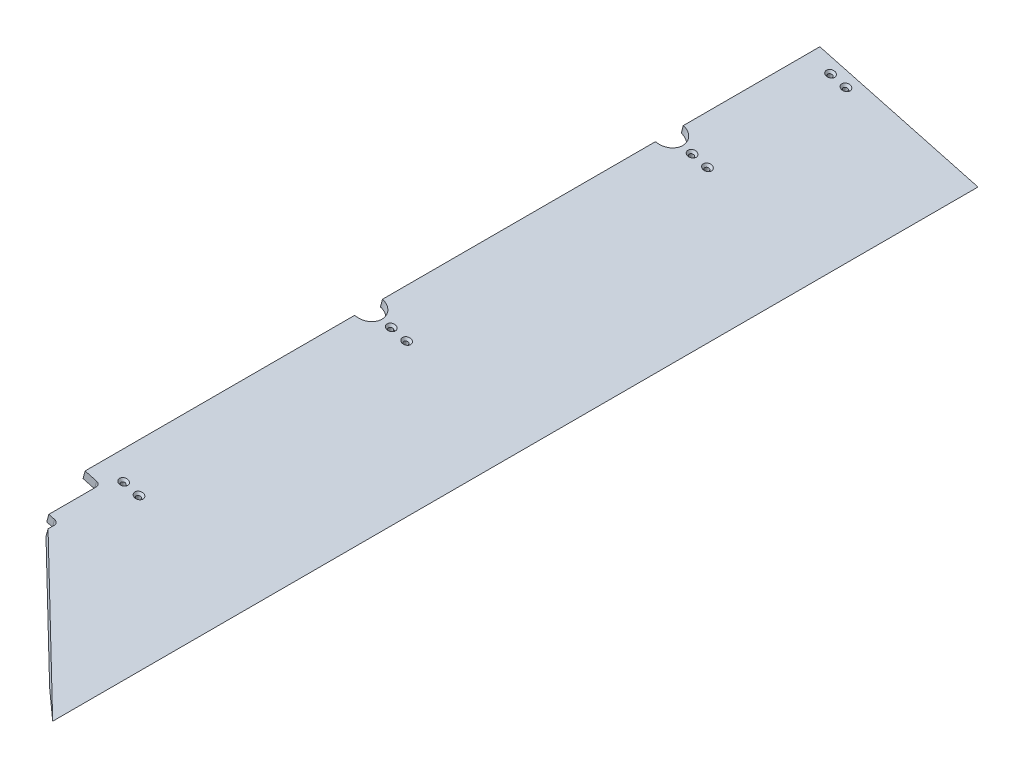
ISO-10303-21;
HEADER;
FILE_DESCRIPTION(('STEP AP214'),'2;1');
FILE_NAME('part.step','',(''),(''),'','','');
FILE_SCHEMA(('AUTOMOTIVE_DESIGN { 1 0 10303 214 1 1 1 1 }'));
ENDSEC;
DATA;
#1=APPLICATION_CONTEXT('core data for automotive mechanical design processes');
#2=APPLICATION_PROTOCOL_DEFINITION('international standard','automotive_design',2000,#1);
#3=PRODUCT_CONTEXT('',#1,'mechanical');
#4=PRODUCT('Part','Part','',(#3));
#5=PRODUCT_RELATED_PRODUCT_CATEGORY('part','',(#4));
#6=PRODUCT_DEFINITION_FORMATION('','',#4);
#7=PRODUCT_DEFINITION_CONTEXT('part definition',#1,'design');
#8=PRODUCT_DEFINITION('design','',#6,#7);
#9=PRODUCT_DEFINITION_SHAPE('','',#8);
#10=(LENGTH_UNIT() NAMED_UNIT(*) SI_UNIT(.MILLI.,.METRE.));
#11=(NAMED_UNIT(*) PLANE_ANGLE_UNIT() SI_UNIT($,.RADIAN.));
#12=(NAMED_UNIT(*) SI_UNIT($,.STERADIAN.) SOLID_ANGLE_UNIT());
#13=UNCERTAINTY_MEASURE_WITH_UNIT(LENGTH_MEASURE(1.E-05),#10,'distance_accuracy_value','');
#14=(GEOMETRIC_REPRESENTATION_CONTEXT(3) GLOBAL_UNCERTAINTY_ASSIGNED_CONTEXT((#13)) GLOBAL_UNIT_ASSIGNED_CONTEXT((#10,
#11,#12)) REPRESENTATION_CONTEXT('',''));
#15=CARTESIAN_POINT('',(0.,0.,0.));
#16=DIRECTION('',(0.,0.,1.));
#17=DIRECTION('',(1.,0.,0.));
#18=AXIS2_PLACEMENT_3D('',#15,#16,#17);
#19=CARTESIAN_POINT('',(25.512001872802,67.770934414059,1479.55));
#20=DIRECTION('',(0.965925826289067,-0.258819045102524,0.));
#21=DIRECTION('',(0.258819045102524,0.965925826289068,0.));
#22=AXIS2_PLACEMENT_3D('',#19,#20,#21);
#23=PLANE('',#22);
#24=DIRECTION('',(0.,0.,-1.));
#25=VECTOR('',#24,1.);
#26=CARTESIAN_POINT('',(22.225,55.5036764201878,1479.55));
#27=LINE('',#26,#25);
#28=CARTESIAN_POINT('',(22.225,55.5036764201878,218.28125));
#29=VERTEX_POINT('',#28);
#30=CARTESIAN_POINT('',(22.225,55.5036764201878,0.));
#31=VERTEX_POINT('',#30);
#32=EDGE_CURVE('E271',#29,#31,#27,.T.);
#33=ORIENTED_EDGE('',*,*,#32,.F.);
#34=DIRECTION('',(0.258819045102524,0.965925826289067,0.));
#35=VECTOR('',#34,1.);
#36=CARTESIAN_POINT('',(8.34908089495289,3.71804131843699,218.28125));
#37=LINE('',#36,#35);
#38=CARTESIAN_POINT('',(25.5120018728021,67.770934414059,218.28125));
#39=VERTEX_POINT('',#38);
#40=EDGE_CURVE('E193',#29,#39,#37,.T.);
#41=ORIENTED_EDGE('',*,*,#40,.T.);
#42=DIRECTION('',(0.,0.,-1.));
#43=VECTOR('',#42,1.);
#44=CARTESIAN_POINT('',(25.512001872802,67.770934414059,1479.55));
#45=LINE('',#44,#43);
#46=CARTESIAN_POINT('',(25.512001872802,67.770934414059,0.));
#47=VERTEX_POINT('',#46);
#48=EDGE_CURVE('E263',#39,#47,#45,.T.);
#49=ORIENTED_EDGE('',*,*,#48,.T.);
#50=DIRECTION('',(-0.258819045102524,-0.965925826289068,0.));
#51=VECTOR('',#50,1.);
#52=CARTESIAN_POINT('',(25.512001872802,67.770934414059,0.));
#53=LINE('',#52,#51);
#54=EDGE_CURVE('E252',#47,#31,#53,.T.);
#55=ORIENTED_EDGE('',*,*,#54,.T.);
#56=EDGE_LOOP('',(#33,#41,#49,#55));
#57=FACE_BOUND('',#56,.T.);
#58=ADVANCED_FACE('F32',(#57),#23,.F.);
#59=CARTESIAN_POINT('',(25.5120018728021,67.770934414059,699.29375));
#60=VERTEX_POINT('',#59);
#61=CARTESIAN_POINT('',(25.512001872802,67.770934414059,262.73125));
#62=VERTEX_POINT('',#61);
#63=EDGE_CURVE('E267',#60,#62,#45,.T.);
#64=ORIENTED_EDGE('',*,*,#63,.T.);
#65=DIRECTION('',(0.258819045102524,0.965925826289067,0.));
#66=VECTOR('',#65,1.);
#67=CARTESIAN_POINT('',(8.34908089495289,3.71804131843699,262.73125));
#68=LINE('',#67,#66);
#69=CARTESIAN_POINT('',(22.225,55.5036764201878,262.73125));
#70=VERTEX_POINT('',#69);
#71=EDGE_CURVE('E190',#62,#70,#68,.F.);
#72=ORIENTED_EDGE('',*,*,#71,.T.);
#73=CARTESIAN_POINT('',(22.225,55.5036764201878,699.29375));
#74=VERTEX_POINT('',#73);
#75=EDGE_CURVE('E275',#74,#70,#27,.T.);
#76=ORIENTED_EDGE('',*,*,#75,.F.);
#77=DIRECTION('',(0.258819045102524,0.965925826289067,0.));
#78=VECTOR('',#77,1.);
#79=CARTESIAN_POINT('',(8.34908089495289,3.718041318437,699.29375));
#80=LINE('',#79,#78);
#81=EDGE_CURVE('E184',#74,#60,#80,.T.);
#82=ORIENTED_EDGE('',*,*,#81,.T.);
#83=EDGE_LOOP('',(#64,#72,#76,#82));
#84=FACE_BOUND('',#83,.T.);
#85=ADVANCED_FACE('F343',(#84),#23,.F.);
#86=CARTESIAN_POINT('',(22.225,55.5036764201878,1174.75));
#87=VERTEX_POINT('',#86);
#88=CARTESIAN_POINT('',(22.225,55.5036764201878,743.74375));
#89=VERTEX_POINT('',#88);
#90=EDGE_CURVE('E272',#87,#89,#27,.T.);
#91=ORIENTED_EDGE('',*,*,#90,.F.);
#92=DIRECTION('',(0.258819045102524,0.965925826289067,0.));
#93=VECTOR('',#92,1.);
#94=CARTESIAN_POINT('',(8.34908089495287,3.71804131843699,1174.75));
#95=LINE('',#94,#93);
#96=CARTESIAN_POINT('',(25.5120018728021,67.770934414059,1174.75));
#97=VERTEX_POINT('',#96);
#98=EDGE_CURVE('E158',#87,#97,#95,.T.);
#99=ORIENTED_EDGE('',*,*,#98,.T.);
#100=CARTESIAN_POINT('',(25.512001872802,67.770934414059,743.74375));
#101=VERTEX_POINT('',#100);
#102=EDGE_CURVE('E264',#97,#101,#45,.T.);
#103=ORIENTED_EDGE('',*,*,#102,.T.);
#104=DIRECTION('',(0.258819045102524,0.965925826289067,0.));
#105=VECTOR('',#104,1.);
#106=CARTESIAN_POINT('',(8.34908089495289,3.718041318437,743.74375));
#107=LINE('',#106,#105);
#108=EDGE_CURVE('E181',#101,#89,#107,.F.);
#109=ORIENTED_EDGE('',*,*,#108,.T.);
#110=EDGE_LOOP('',(#91,#99,#103,#109));
#111=FACE_BOUND('',#110,.T.);
#112=ADVANCED_FACE('F354',(#111),#23,.F.);
#113=CARTESIAN_POINT('',(22.225,55.5036764201878,1479.55));
#114=DIRECTION('',(0.258819045102524,0.965925826289067,0.));
#115=DIRECTION('',(-0.965925826289067,0.258819045102524,0.));
#116=AXIS2_PLACEMENT_3D('',#113,#114,#115);
#117=PLANE('',#116);
#118=CARTESIAN_POINT('',(58.5115491458709,45.7807248804393,721.51875));
#119=DIRECTION('',(0.258819045102524,0.965925826289067,0.));
#120=DIRECTION('',(-0.965925826289067,0.258819045102524,0.));
#121=AXIS2_PLACEMENT_3D('',#118,#119,#120);
#122=CIRCLE('',#121,3.57123999999998);
#123=CARTESIAN_POINT('',(55.0619961979943,46.7050298070713,721.51875));
#124=VERTEX_POINT('',#123);
#125=EDGE_CURVE('E202',#124,#124,#122,.T.);
#126=ORIENTED_EDGE('',*,*,#125,.T.);
#127=EDGE_LOOP('',(#126));
#128=FACE_BOUND('',#127,.T.);
#129=CARTESIAN_POINT('',(83.0460651336132,39.2067211348352,721.51875));
#130=DIRECTION('',(0.258819045102524,0.965925826289067,0.));
#131=DIRECTION('',(-0.965925826289067,0.258819045102524,0.));
#132=AXIS2_PLACEMENT_3D('',#129,#130,#131);
#133=CIRCLE('',#132,3.57123999999998);
#134=CARTESIAN_POINT('',(79.5965121857366,40.1310260614672,721.51875));
#135=VERTEX_POINT('',#134);
#136=EDGE_CURVE('E209',#135,#135,#133,.T.);
#137=ORIENTED_EDGE('',*,*,#136,.T.);
#138=EDGE_LOOP('',(#137));
#139=FACE_BOUND('',#138,.T.);
#140=CARTESIAN_POINT('',(58.5115491458709,45.7807248804393,240.50625));
#141=DIRECTION('',(0.258819045102524,0.965925826289067,0.));
#142=DIRECTION('',(-0.965925826289067,0.258819045102524,0.));
#143=AXIS2_PLACEMENT_3D('',#140,#141,#142);
#144=CIRCLE('',#143,3.57123999999999);
#145=CARTESIAN_POINT('',(55.0619961979943,46.7050298070713,240.50625));
#146=VERTEX_POINT('',#145);
#147=EDGE_CURVE('E216',#146,#146,#144,.T.);
#148=ORIENTED_EDGE('',*,*,#147,.T.);
#149=EDGE_LOOP('',(#148));
#150=FACE_BOUND('',#149,.T.);
#151=CARTESIAN_POINT('',(83.0460651336132,39.2067211348352,240.50625));
#152=DIRECTION('',(0.258819045102524,0.965925826289067,0.));
#153=DIRECTION('',(-0.965925826289067,0.258819045102524,0.));
#154=AXIS2_PLACEMENT_3D('',#151,#152,#153);
#155=CIRCLE('',#154,3.57123999999999);
#156=CARTESIAN_POINT('',(79.5965121857366,40.1310260614672,240.50625));
#157=VERTEX_POINT('',#156);
#158=EDGE_CURVE('E223',#157,#157,#155,.T.);
#159=ORIENTED_EDGE('',*,*,#158,.T.);
#160=EDGE_LOOP('',(#159));
#161=FACE_BOUND('',#160,.T.);
#162=CARTESIAN_POINT('',(58.5115491458709,45.7807248804393,1149.35));
#163=DIRECTION('',(0.258819045102524,0.965925826289067,0.));
#164=DIRECTION('',(-0.965925826289067,0.258819045102524,0.));
#165=AXIS2_PLACEMENT_3D('',#162,#163,#164);
#166=CIRCLE('',#165,3.57124000000009);
#167=CARTESIAN_POINT('',(55.0619961979942,46.7050298070713,1149.35));
#168=VERTEX_POINT('',#167);
#169=EDGE_CURVE('E230',#168,#168,#166,.T.);
#170=ORIENTED_EDGE('',*,*,#169,.T.);
#171=EDGE_LOOP('',(#170));
#172=FACE_BOUND('',#171,.T.);
#173=CARTESIAN_POINT('',(83.0460651336132,39.2067211348352,1149.35));
#174=DIRECTION('',(0.258819045102524,0.965925826289067,0.));
#175=DIRECTION('',(-0.965925826289067,0.258819045102524,0.));
#176=AXIS2_PLACEMENT_3D('',#173,#174,#175);
#177=CIRCLE('',#176,3.57124000000009);
#178=CARTESIAN_POINT('',(79.5965121857365,40.1310260614672,1149.35));
#179=VERTEX_POINT('',#178);
#180=EDGE_CURVE('E237',#179,#179,#177,.T.);
#181=ORIENTED_EDGE('',*,*,#180,.T.);
#182=EDGE_LOOP('',(#181));
#183=FACE_BOUND('',#182,.T.);
#184=CARTESIAN_POINT('',(58.5115491458709,45.7807248804393,19.05));
#185=DIRECTION('',(0.258819045102524,0.965925826289067,0.));
#186=DIRECTION('',(-0.965925826289067,0.258819045102524,0.));
#187=AXIS2_PLACEMENT_3D('',#184,#185,#186);
#188=CIRCLE('',#187,3.57123999999999);
#189=CARTESIAN_POINT('',(55.0619961979943,46.7050298070713,19.05));
#190=VERTEX_POINT('',#189);
#191=EDGE_CURVE('E244',#190,#190,#188,.T.);
#192=ORIENTED_EDGE('',*,*,#191,.T.);
#193=EDGE_LOOP('',(#192));
#194=FACE_BOUND('',#193,.T.);
#195=CARTESIAN_POINT('',(83.0460651336132,39.2067211348352,19.05));
#196=DIRECTION('',(0.258819045102524,0.965925826289067,0.));
#197=DIRECTION('',(-0.965925826289067,0.258819045102524,0.));
#198=AXIS2_PLACEMENT_3D('',#195,#196,#197);
#199=CIRCLE('',#198,3.57123999999999);
#200=CARTESIAN_POINT('',(79.5965121857366,40.1310260614672,19.05));
#201=VERTEX_POINT('',#200);
#202=EDGE_CURVE('E251',#201,#201,#199,.T.);
#203=ORIENTED_EDGE('',*,*,#202,.T.);
#204=EDGE_LOOP('',(#203));
#205=FACE_BOUND('',#204,.T.);
#206=DIRECTION('',(0.,0.,-1.));
#207=VECTOR('',#206,1.);
#208=CARTESIAN_POINT('',(46.7595159877423,48.9296726745837,1479.55));
#209=LINE('',#208,#207);
#210=CARTESIAN_POINT('',(46.7595159877423,48.9296726745837,1257.3));
#211=VERTEX_POINT('',#210);
#212=CARTESIAN_POINT('',(46.7595159877423,48.9296726745837,1181.1));
#213=VERTEX_POINT('',#212);
#214=EDGE_CURVE('E169',#211,#213,#209,.T.);
#215=ORIENTED_EDGE('',*,*,#214,.T.);
#216=CARTESIAN_POINT('',(40.6258869908067,50.5731736109847,1181.1));
#217=DIRECTION('',(0.258819045102524,0.965925826289067,0.));
#218=DIRECTION('',(-0.965925826289067,0.258819045102524,0.));
#219=AXIS2_PLACEMENT_3D('',#216,#217,#218);
#220=CIRCLE('',#219,6.35);
#221=CARTESIAN_POINT('',(40.6258869908067,50.5731736109847,1174.75));
#222=VERTEX_POINT('',#221);
#223=EDGE_CURVE('E302',#213,#222,#220,.T.);
#224=ORIENTED_EDGE('',*,*,#223,.T.);
#225=DIRECTION('',(-0.965925826289067,0.258819045102524,0.));
#226=VECTOR('',#225,1.);
#227=CARTESIAN_POINT('',(22.225,55.5036764201878,1174.75));
#228=LINE('',#227,#226);
#229=EDGE_CURVE('E172',#222,#87,#228,.T.);
#230=ORIENTED_EDGE('',*,*,#229,.T.);
#231=ORIENTED_EDGE('',*,*,#90,.T.);
#232=CARTESIAN_POINT('',(22.225,55.5036764201878,721.51875));
#233=DIRECTION('',(0.258819045102524,0.965925826289067,0.));
#234=DIRECTION('',(-0.965925826289067,0.258819045102524,0.));
#235=AXIS2_PLACEMENT_3D('',#232,#233,#234);
#236=CIRCLE('',#235,22.225);
#237=EDGE_CURVE('E177',#89,#74,#236,.T.);
#238=ORIENTED_EDGE('',*,*,#237,.T.);
#239=ORIENTED_EDGE('',*,*,#75,.T.);
#240=CARTESIAN_POINT('',(22.225,55.5036764201878,240.50625));
#241=DIRECTION('',(0.258819045102524,0.965925826289067,0.));
#242=DIRECTION('',(-0.965925826289067,0.258819045102524,0.));
#243=AXIS2_PLACEMENT_3D('',#240,#241,#242);
#244=CIRCLE('',#243,22.225);
#245=EDGE_CURVE('E187',#70,#29,#244,.T.);
#246=ORIENTED_EDGE('',*,*,#245,.T.);
#247=ORIENTED_EDGE('',*,*,#32,.T.);
#248=DIRECTION('',(0.965925826289067,-0.258819045102524,0.));
#249=VECTOR('',#248,1.);
#250=CARTESIAN_POINT('',(22.225,55.5036764201878,0.));
#251=LINE('',#250,#249);
#252=CARTESIAN_POINT('',(229.367540407001,0.,0.));
#253=VERTEX_POINT('',#252);
#254=EDGE_CURVE('E255',#31,#253,#251,.T.);
#255=ORIENTED_EDGE('',*,*,#254,.T.);
#256=DIRECTION('',(0.,0.,-1.));
#257=VECTOR('',#256,1.);
#258=CARTESIAN_POINT('',(229.367540407001,0.,1479.55));
#259=LINE('',#258,#257);
#260=CARTESIAN_POINT('',(229.367540407001,0.,1435.35154026031));
#261=VERTEX_POINT('',#260);
#262=EDGE_CURVE('E269',#261,#253,#259,.T.);
#263=ORIENTED_EDGE('',*,*,#262,.F.);
#264=DIRECTION('',(-0.706433428546067,0.189288266685271,-0.681998360062496));
#265=VECTOR('',#264,1.);
#266=CARTESIAN_POINT('',(139.865722173839,23.9819399166931,1348.9455311573));
#267=LINE('',#266,#265);
#268=CARTESIAN_POINT('',(62.0935884800813,44.8209203335811,1273.8634845066));
#269=VERTEX_POINT('',#268);
#270=EDGE_CURVE('E164',#261,#269,#267,.T.);
#271=ORIENTED_EDGE('',*,*,#270,.T.);
#272=DIRECTION('',(0.,0.,-1.));
#273=VECTOR('',#272,1.);
#274=CARTESIAN_POINT('',(62.0935884800813,44.8209203335811,1479.55));
#275=LINE('',#274,#273);
#276=CARTESIAN_POINT('',(62.0935884800813,44.8209203335811,1263.65));
#277=VERTEX_POINT('',#276);
#278=EDGE_CURVE('E134',#269,#277,#275,.T.);
#279=ORIENTED_EDGE('',*,*,#278,.T.);
#280=CARTESIAN_POINT('',(55.9599594831457,46.4644212699822,1263.65));
#281=DIRECTION('',(0.258819045102524,0.965925826289067,0.));
#282=DIRECTION('',(-0.965925826289067,0.258819045102524,0.));
#283=AXIS2_PLACEMENT_3D('',#280,#281,#282);
#284=CIRCLE('',#283,6.35);
#285=CARTESIAN_POINT('',(55.9599594831457,46.4644212699822,1257.3));
#286=VERTEX_POINT('',#285);
#287=EDGE_CURVE('E11',#277,#286,#284,.T.);
#288=ORIENTED_EDGE('',*,*,#287,.T.);
#289=DIRECTION('',(-0.965925826289067,0.258819045102524,0.));
#290=VECTOR('',#289,1.);
#291=CARTESIAN_POINT('',(22.225,55.5036764201878,1257.3));
#292=LINE('',#291,#290);
#293=EDGE_CURVE('E167',#286,#211,#292,.T.);
#294=ORIENTED_EDGE('',*,*,#293,.T.);
#295=EDGE_LOOP('',(#215,#224,#230,#231,#238,#239,#246,#247,#255,#263,#271,#279,#288,#294));
#296=FACE_BOUND('',#295,.T.);
#297=ADVANCED_FACE('F306',(#128,#139,#150,#161,#172,#183,#194,#205,#296),#117,.F.);
#298=CARTESIAN_POINT('',(229.367540407001,0.,1479.55));
#299=DIRECTION('',(0.,1.,0.));
#300=DIRECTION('',(0.,0.,1.));
#301=AXIS2_PLACEMENT_3D('',#298,#299,#300);
#302=PLANE('',#301);
#303=DIRECTION('',(0.,0.,-1.));
#304=VECTOR('',#303,1.);
#305=CARTESIAN_POINT('',(278.436572382485,0.,1479.55));
#306=LINE('',#305,#304);
#307=CARTESIAN_POINT('',(278.436572382485,0.,1479.55));
#308=VERTEX_POINT('',#307);
#309=CARTESIAN_POINT('',(278.436572382485,0.,0.));
#310=VERTEX_POINT('',#309);
#311=EDGE_CURVE('E266',#308,#310,#306,.T.);
#312=ORIENTED_EDGE('',*,*,#311,.F.);
#313=DIRECTION('',(-0.743020535718653,0.,-0.669268618344209));
#314=VECTOR('',#313,1.);
#315=CARTESIAN_POINT('',(251.346564934355,0.,1455.14893571689));
#316=LINE('',#315,#314);
#317=EDGE_CURVE('E144',#308,#261,#316,.T.);
#318=ORIENTED_EDGE('',*,*,#317,.T.);
#319=ORIENTED_EDGE('',*,*,#262,.T.);
#320=DIRECTION('',(1.,0.,0.));
#321=VECTOR('',#320,1.);
#322=CARTESIAN_POINT('',(229.367540407001,0.,0.));
#323=LINE('',#322,#321);
#324=EDGE_CURVE('E258',#253,#310,#323,.T.);
#325=ORIENTED_EDGE('',*,*,#324,.T.);
#326=EDGE_LOOP('',(#312,#318,#319,#325));
#327=FACE_BOUND('',#326,.T.);
#328=ADVANCED_FACE('F329',(#327),#302,.F.);
#329=CARTESIAN_POINT('',(278.436572382485,0.,1479.55));
#330=DIRECTION('',(-0.258819045102524,-0.965925826289067,0.));
#331=DIRECTION('',(0.965925826289068,-0.258819045102524,0.));
#332=AXIS2_PLACEMENT_3D('',#329,#330,#331);
#333=PLANE('',#332);
#334=CARTESIAN_POINT('',(61.7985510186729,58.0479828743105,721.51875));
#335=DIRECTION('',(0.258819045102524,0.965925826289068,0.));
#336=DIRECTION('',(-0.965925826289068,0.258819045102524,0.));
#337=AXIS2_PLACEMENT_3D('',#334,#335,#336);
#338=CIRCLE('',#337,6.74370000000002);
#339=CARTESIAN_POINT('',(55.2846370239273,59.7933808687684,721.51875));
#340=VERTEX_POINT('',#339);
#341=EDGE_CURVE('E196',#340,#340,#338,.T.);
#342=ORIENTED_EDGE('',*,*,#341,.F.);
#343=EDGE_LOOP('',(#342));
#344=FACE_BOUND('',#343,.T.);
#345=CARTESIAN_POINT('',(86.3330670064153,51.4739791287064,721.51875));
#346=DIRECTION('',(0.258819045102524,0.965925826289068,0.));
#347=DIRECTION('',(-0.965925826289068,0.258819045102524,0.));
#348=AXIS2_PLACEMENT_3D('',#345,#346,#347);
#349=CIRCLE('',#348,6.74370000000002);
#350=CARTESIAN_POINT('',(79.8191530116697,53.2193771231643,721.51875));
#351=VERTEX_POINT('',#350);
#352=EDGE_CURVE('E203',#351,#351,#349,.T.);
#353=ORIENTED_EDGE('',*,*,#352,.F.);
#354=EDGE_LOOP('',(#353));
#355=FACE_BOUND('',#354,.T.);
#356=CARTESIAN_POINT('',(61.7985510186729,58.0479828743105,240.50625));
#357=DIRECTION('',(0.258819045102524,0.965925826289068,0.));
#358=DIRECTION('',(-0.965925826289068,0.258819045102524,0.));
#359=AXIS2_PLACEMENT_3D('',#356,#357,#358);
#360=CIRCLE('',#359,6.74369999999999);
#361=CARTESIAN_POINT('',(55.2846370239274,59.7933808687684,240.50625));
#362=VERTEX_POINT('',#361);
#363=EDGE_CURVE('E210',#362,#362,#360,.T.);
#364=ORIENTED_EDGE('',*,*,#363,.F.);
#365=EDGE_LOOP('',(#364));
#366=FACE_BOUND('',#365,.T.);
#367=CARTESIAN_POINT('',(86.3330670064153,51.4739791287064,240.50625));
#368=DIRECTION('',(0.258819045102524,0.965925826289068,0.));
#369=DIRECTION('',(-0.965925826289068,0.258819045102524,0.));
#370=AXIS2_PLACEMENT_3D('',#367,#368,#369);
#371=CIRCLE('',#370,6.74369999999999);
#372=CARTESIAN_POINT('',(79.8191530116697,53.2193771231643,240.50625));
#373=VERTEX_POINT('',#372);
#374=EDGE_CURVE('E217',#373,#373,#371,.T.);
#375=ORIENTED_EDGE('',*,*,#374,.F.);
#376=EDGE_LOOP('',(#375));
#377=FACE_BOUND('',#376,.T.);
#378=CARTESIAN_POINT('',(61.798551018673,58.0479828743105,1149.35));
#379=DIRECTION('',(0.258819045102524,0.965925826289068,0.));
#380=DIRECTION('',(-0.965925826289068,0.258819045102524,0.));
#381=AXIS2_PLACEMENT_3D('',#378,#379,#380);
#382=CIRCLE('',#381,6.74369999999991);
#383=CARTESIAN_POINT('',(55.2846370239275,59.7933808687684,1149.35));
#384=VERTEX_POINT('',#383);
#385=EDGE_CURVE('E224',#384,#384,#382,.T.);
#386=ORIENTED_EDGE('',*,*,#385,.F.);
#387=EDGE_LOOP('',(#386));
#388=FACE_BOUND('',#387,.T.);
#389=CARTESIAN_POINT('',(86.3330670064153,51.4739791287064,1149.35));
#390=DIRECTION('',(0.258819045102524,0.965925826289068,0.));
#391=DIRECTION('',(-0.965925826289068,0.258819045102524,0.));
#392=AXIS2_PLACEMENT_3D('',#389,#390,#391);
#393=CIRCLE('',#392,6.74369999999991);
#394=CARTESIAN_POINT('',(79.8191530116698,53.2193771231643,1149.35));
#395=VERTEX_POINT('',#394);
#396=EDGE_CURVE('E231',#395,#395,#393,.T.);
#397=ORIENTED_EDGE('',*,*,#396,.F.);
#398=EDGE_LOOP('',(#397));
#399=FACE_BOUND('',#398,.T.);
#400=CARTESIAN_POINT('',(61.798551018673,58.0479828743105,19.05));
#401=DIRECTION('',(0.258819045102524,0.965925826289068,0.));
#402=DIRECTION('',(-0.965925826289068,0.258819045102524,0.));
#403=AXIS2_PLACEMENT_3D('',#400,#401,#402);
#404=CIRCLE('',#403,6.7437);
#405=CARTESIAN_POINT('',(55.2846370239274,59.7933808687684,19.05));
#406=VERTEX_POINT('',#405);
#407=EDGE_CURVE('E238',#406,#406,#404,.T.);
#408=ORIENTED_EDGE('',*,*,#407,.F.);
#409=EDGE_LOOP('',(#408));
#410=FACE_BOUND('',#409,.T.);
#411=CARTESIAN_POINT('',(86.3330670064153,51.4739791287064,19.05));
#412=DIRECTION('',(0.258819045102524,0.965925826289068,0.));
#413=DIRECTION('',(-0.965925826289068,0.258819045102524,0.));
#414=AXIS2_PLACEMENT_3D('',#411,#412,#413);
#415=CIRCLE('',#414,6.7437);
#416=CARTESIAN_POINT('',(79.8191530116697,53.2193771231643,19.05));
#417=VERTEX_POINT('',#416);
#418=EDGE_CURVE('E245',#417,#417,#415,.T.);
#419=ORIENTED_EDGE('',*,*,#418,.F.);
#420=EDGE_LOOP('',(#419));
#421=FACE_BOUND('',#420,.T.);
#422=ORIENTED_EDGE('',*,*,#102,.F.);
#423=DIRECTION('',(-0.965925826289067,0.258819045102524,0.));
#424=VECTOR('',#423,1.);
#425=CARTESIAN_POINT('',(50.0465178605444,61.1969306684549,1174.75));
#426=LINE('',#425,#424);
#427=CARTESIAN_POINT('',(43.9128888636088,62.8404316048559,1174.75));
#428=VERTEX_POINT('',#427);
#429=EDGE_CURVE('E138',#428,#97,#426,.T.);
#430=ORIENTED_EDGE('',*,*,#429,.F.);
#431=CARTESIAN_POINT('',(43.9128888636088,62.8404316048559,1181.1));
#432=DIRECTION('',(-0.258819045102524,-0.965925826289067,0.));
#433=DIRECTION('',(0.965925826289068,-0.258819045102524,0.));
#434=AXIS2_PLACEMENT_3D('',#431,#432,#433);
#435=CIRCLE('',#434,6.35);
#436=CARTESIAN_POINT('',(50.0465178605444,61.1969306684549,1181.1));
#437=VERTEX_POINT('',#436);
#438=EDGE_CURVE('E300',#428,#437,#435,.T.);
#439=ORIENTED_EDGE('',*,*,#438,.T.);
#440=DIRECTION('',(0.,0.,-1.));
#441=VECTOR('',#440,1.);
#442=CARTESIAN_POINT('',(50.0465178605444,61.1969306684549,1257.3));
#443=LINE('',#442,#441);
#444=CARTESIAN_POINT('',(50.0465178605444,61.1969306684549,1257.3));
#445=VERTEX_POINT('',#444);
#446=EDGE_CURVE('E152',#445,#437,#443,.T.);
#447=ORIENTED_EDGE('',*,*,#446,.F.);
#448=DIRECTION('',(-0.965925826289067,0.258819045102524,0.));
#449=VECTOR('',#448,1.);
#450=CARTESIAN_POINT('',(65.3805903528833,57.0881783274523,1257.3));
#451=LINE('',#450,#449);
#452=CARTESIAN_POINT('',(59.2469613559478,58.7316792638534,1257.3));
#453=VERTEX_POINT('',#452);
#454=EDGE_CURVE('E150',#453,#445,#451,.T.);
#455=ORIENTED_EDGE('',*,*,#454,.F.);
#456=CARTESIAN_POINT('',(59.2469613559478,58.7316792638533,1263.65));
#457=DIRECTION('',(-0.258819045102524,-0.965925826289067,0.));
#458=DIRECTION('',(0.965925826289068,-0.258819045102524,0.));
#459=AXIS2_PLACEMENT_3D('',#456,#457,#458);
#460=CIRCLE('',#459,6.35);
#461=CARTESIAN_POINT('',(65.3805903528833,57.0881783274523,1263.65));
#462=VERTEX_POINT('',#461);
#463=EDGE_CURVE('E40',#453,#462,#460,.T.);
#464=ORIENTED_EDGE('',*,*,#463,.T.);
#465=DIRECTION('',(0.,0.,-1.));
#466=VECTOR('',#465,1.);
#467=CARTESIAN_POINT('',(65.3805903528833,57.0881783274523,1273.8634845066));
#468=LINE('',#467,#466);
#469=CARTESIAN_POINT('',(65.3805903528833,57.0881783274523,1273.8634845066));
#470=VERTEX_POINT('',#469);
#471=EDGE_CURVE('E133',#470,#462,#468,.T.);
#472=ORIENTED_EDGE('',*,*,#471,.F.);
#473=DIRECTION('',(-0.706433428546067,0.18928826668527,-0.681998360062496));
#474=VECTOR('',#473,1.);
#475=CARTESIAN_POINT('',(278.436572382485,0.,1479.55));
#476=LINE('',#475,#474);
#477=EDGE_CURVE('E141',#308,#470,#476,.T.);
#478=ORIENTED_EDGE('',*,*,#477,.F.);
#479=ORIENTED_EDGE('',*,*,#311,.T.);
#480=DIRECTION('',(-0.965925826289068,0.258819045102524,0.));
#481=VECTOR('',#480,1.);
#482=CARTESIAN_POINT('',(278.436572382485,0.,0.));
#483=LINE('',#482,#481);
#484=EDGE_CURVE('E260',#310,#47,#483,.T.);
#485=ORIENTED_EDGE('',*,*,#484,.T.);
#486=ORIENTED_EDGE('',*,*,#48,.F.);
#487=CARTESIAN_POINT('',(25.512001872802,67.770934414059,240.50625));
#488=DIRECTION('',(0.258819045102524,0.965925826289068,0.));
#489=DIRECTION('',(-0.965925826289068,0.258819045102524,0.));
#490=AXIS2_PLACEMENT_3D('',#487,#488,#489);
#491=CIRCLE('',#490,22.225);
#492=EDGE_CURVE('E175',#62,#39,#491,.T.);
#493=ORIENTED_EDGE('',*,*,#492,.F.);
#494=ORIENTED_EDGE('',*,*,#63,.F.);
#495=CARTESIAN_POINT('',(25.5120018728021,67.770934414059,721.51875));
#496=DIRECTION('',(0.258819045102524,0.965925826289068,0.));
#497=DIRECTION('',(-0.965925826289068,0.258819045102524,0.));
#498=AXIS2_PLACEMENT_3D('',#495,#496,#497);
#499=CIRCLE('',#498,22.225);
#500=EDGE_CURVE('E174',#101,#60,#499,.T.);
#501=ORIENTED_EDGE('',*,*,#500,.F.);
#502=EDGE_LOOP('',(#422,#430,#439,#447,#455,#464,#472,#478,#479,#485,#486,#493,#494,#501));
#503=FACE_BOUND('',#502,.T.);
#504=ADVANCED_FACE('F149',(#344,#355,#366,#377,#388,#399,#410,#421,#503),#333,.F.);
#505=CARTESIAN_POINT('',(0.,0.,0.));
#506=DIRECTION('',(0.,0.,1.));
#507=DIRECTION('',(1.,0.,0.));
#508=AXIS2_PLACEMENT_3D('',#505,#506,#507);
#509=PLANE('',#508);
#510=ORIENTED_EDGE('',*,*,#54,.F.);
#511=ORIENTED_EDGE('',*,*,#484,.F.);
#512=ORIENTED_EDGE('',*,*,#324,.F.);
#513=ORIENTED_EDGE('',*,*,#254,.F.);
#514=EDGE_LOOP('',(#510,#511,#512,#513));
#515=FACE_BOUND('',#514,.T.);
#516=ADVANCED_FACE('F335',(#515),#509,.F.);
#517=CARTESIAN_POINT('',(86.3330670064153,51.4739791287064,19.05));
#518=DIRECTION('',(0.258819045102524,0.965925826289068,0.));
#519=DIRECTION('',(-0.965925826289068,0.258819045102524,0.));
#520=AXIS2_PLACEMENT_3D('',#517,#518,#519);
#521=CYLINDRICAL_SURFACE('',#520,3.57123999999999);
#522=CARTESIAN_POINT('',(85.3885074818001,47.9488349920696,19.05));
#523=DIRECTION('',(0.258819045102524,0.965925826289068,0.));
#524=DIRECTION('',(-0.965925826289068,0.258819045102524,0.));
#525=AXIS2_PLACEMENT_3D('',#522,#523,#524);
#526=CIRCLE('',#525,3.57124);
#527=CARTESIAN_POINT('',(81.9389545339235,48.8731399187016,19.05));
#528=VERTEX_POINT('',#527);
#529=EDGE_CURVE('E248',#528,#528,#526,.T.);
#530=ORIENTED_EDGE('',*,*,#529,.T.);
#531=EDGE_LOOP('',(#530));
#532=FACE_BOUND('',#531,.T.);
#533=ORIENTED_EDGE('',*,*,#202,.F.);
#534=EDGE_LOOP('',(#533));
#535=FACE_BOUND('',#534,.T.);
#536=ADVANCED_FACE('F535',(#532,#535),#521,.F.);
#537=CARTESIAN_POINT('',(86.3330670064153,51.4739791287064,19.05));
#538=DIRECTION('',(0.258819045102524,0.965925826289068,0.));
#539=DIRECTION('',(-0.965925826289068,0.258819045102524,0.));
#540=AXIS2_PLACEMENT_3D('',#537,#538,#539);
#541=CONICAL_SURFACE('',#540,6.7437,0.715584993317675);
#542=ORIENTED_EDGE('',*,*,#529,.F.);
#543=EDGE_LOOP('',(#542));
#544=FACE_BOUND('',#543,.T.);
#545=ORIENTED_EDGE('',*,*,#418,.T.);
#546=EDGE_LOOP('',(#545));
#547=FACE_BOUND('',#546,.T.);
#548=ADVANCED_FACE('F531',(#544,#547),#541,.F.);
#549=CARTESIAN_POINT('',(61.798551018673,58.0479828743105,19.05));
#550=DIRECTION('',(0.258819045102524,0.965925826289068,0.));
#551=DIRECTION('',(-0.965925826289068,0.258819045102524,0.));
#552=AXIS2_PLACEMENT_3D('',#549,#550,#551);
#553=CYLINDRICAL_SURFACE('',#552,3.57123999999999);
#554=CARTESIAN_POINT('',(60.8539914940578,54.5228387376737,19.05));
#555=DIRECTION('',(0.258819045102524,0.965925826289068,0.));
#556=DIRECTION('',(-0.965925826289068,0.258819045102524,0.));
#557=AXIS2_PLACEMENT_3D('',#554,#555,#556);
#558=CIRCLE('',#557,3.57124);
#559=CARTESIAN_POINT('',(57.4044385461812,55.4471436643057,19.05));
#560=VERTEX_POINT('',#559);
#561=EDGE_CURVE('E241',#560,#560,#558,.T.);
#562=ORIENTED_EDGE('',*,*,#561,.T.);
#563=EDGE_LOOP('',(#562));
#564=FACE_BOUND('',#563,.T.);
#565=ORIENTED_EDGE('',*,*,#191,.F.);
#566=EDGE_LOOP('',(#565));
#567=FACE_BOUND('',#566,.T.);
#568=ADVANCED_FACE('F527',(#564,#567),#553,.F.);
#569=CARTESIAN_POINT('',(61.798551018673,58.0479828743105,19.05));
#570=DIRECTION('',(0.258819045102524,0.965925826289068,0.));
#571=DIRECTION('',(-0.965925826289068,0.258819045102524,0.));
#572=AXIS2_PLACEMENT_3D('',#569,#570,#571);
#573=CONICAL_SURFACE('',#572,6.7437,0.715584993317675);
#574=ORIENTED_EDGE('',*,*,#561,.F.);
#575=EDGE_LOOP('',(#574));
#576=FACE_BOUND('',#575,.T.);
#577=ORIENTED_EDGE('',*,*,#407,.T.);
#578=EDGE_LOOP('',(#577));
#579=FACE_BOUND('',#578,.T.);
#580=ADVANCED_FACE('F523',(#576,#579),#573,.F.);
#581=CARTESIAN_POINT('',(86.3330670064153,51.4739791287064,1149.35));
#582=DIRECTION('',(0.258819045102524,0.965925826289068,0.));
#583=DIRECTION('',(-0.965925826289068,0.258819045102524,0.));
#584=AXIS2_PLACEMENT_3D('',#581,#582,#583);
#585=CYLINDRICAL_SURFACE('',#584,3.57124000000009);
#586=CARTESIAN_POINT('',(85.3885074818001,47.9488349920696,1149.35));
#587=DIRECTION('',(0.258819045102524,0.965925826289068,0.));
#588=DIRECTION('',(-0.965925826289068,0.258819045102524,0.));
#589=AXIS2_PLACEMENT_3D('',#586,#587,#588);
#590=CIRCLE('',#589,3.57124000000009);
#591=CARTESIAN_POINT('',(81.9389545339235,48.8731399187016,1149.35));
#592=VERTEX_POINT('',#591);
#593=EDGE_CURVE('E234',#592,#592,#590,.T.);
#594=ORIENTED_EDGE('',*,*,#593,.T.);
#595=EDGE_LOOP('',(#594));
#596=FACE_BOUND('',#595,.T.);
#597=ORIENTED_EDGE('',*,*,#180,.F.);
#598=EDGE_LOOP('',(#597));
#599=FACE_BOUND('',#598,.T.);
#600=ADVANCED_FACE('F519',(#596,#599),#585,.F.);
#601=CARTESIAN_POINT('',(86.3330670064153,51.4739791287064,1149.35));
#602=DIRECTION('',(0.258819045102524,0.965925826289068,0.));
#603=DIRECTION('',(-0.965925826289068,0.258819045102524,0.));
#604=AXIS2_PLACEMENT_3D('',#601,#602,#603);
#605=CONICAL_SURFACE('',#604,6.74369999999991,0.715584993317647);
#606=ORIENTED_EDGE('',*,*,#593,.F.);
#607=EDGE_LOOP('',(#606));
#608=FACE_BOUND('',#607,.T.);
#609=ORIENTED_EDGE('',*,*,#396,.T.);
#610=EDGE_LOOP('',(#609));
#611=FACE_BOUND('',#610,.T.);
#612=ADVANCED_FACE('F515',(#608,#611),#605,.F.);
#613=CARTESIAN_POINT('',(61.798551018673,58.0479828743105,1149.35));
#614=DIRECTION('',(0.258819045102524,0.965925826289068,0.));
#615=DIRECTION('',(-0.965925826289068,0.258819045102524,0.));
#616=AXIS2_PLACEMENT_3D('',#613,#614,#615);
#617=CYLINDRICAL_SURFACE('',#616,3.57124000000009);
#618=CARTESIAN_POINT('',(60.8539914940578,54.5228387376737,1149.35));
#619=DIRECTION('',(0.258819045102524,0.965925826289068,0.));
#620=DIRECTION('',(-0.965925826289068,0.258819045102524,0.));
#621=AXIS2_PLACEMENT_3D('',#618,#619,#620);
#622=CIRCLE('',#621,3.57124000000009);
#623=CARTESIAN_POINT('',(57.4044385461811,55.4471436643057,1149.35));
#624=VERTEX_POINT('',#623);
#625=EDGE_CURVE('E227',#624,#624,#622,.T.);
#626=ORIENTED_EDGE('',*,*,#625,.T.);
#627=EDGE_LOOP('',(#626));
#628=FACE_BOUND('',#627,.T.);
#629=ORIENTED_EDGE('',*,*,#169,.F.);
#630=EDGE_LOOP('',(#629));
#631=FACE_BOUND('',#630,.T.);
#632=ADVANCED_FACE('F511',(#628,#631),#617,.F.);
#633=CARTESIAN_POINT('',(61.798551018673,58.0479828743105,1149.35));
#634=DIRECTION('',(0.258819045102524,0.965925826289068,0.));
#635=DIRECTION('',(-0.965925826289068,0.258819045102524,0.));
#636=AXIS2_PLACEMENT_3D('',#633,#634,#635);
#637=CONICAL_SURFACE('',#636,6.74369999999991,0.715584993317647);
#638=ORIENTED_EDGE('',*,*,#625,.F.);
#639=EDGE_LOOP('',(#638));
#640=FACE_BOUND('',#639,.T.);
#641=ORIENTED_EDGE('',*,*,#385,.T.);
#642=EDGE_LOOP('',(#641));
#643=FACE_BOUND('',#642,.T.);
#644=ADVANCED_FACE('F507',(#640,#643),#637,.F.);
#645=CARTESIAN_POINT('',(86.3330670064153,51.4739791287064,240.50625));
#646=DIRECTION('',(0.258819045102524,0.965925826289068,0.));
#647=DIRECTION('',(-0.965925826289068,0.258819045102524,0.));
#648=AXIS2_PLACEMENT_3D('',#645,#646,#647);
#649=CYLINDRICAL_SURFACE('',#648,3.57123999999999);
#650=CARTESIAN_POINT('',(85.3885074818001,47.9488349920696,240.50625));
#651=DIRECTION('',(0.258819045102524,0.965925826289068,0.));
#652=DIRECTION('',(-0.965925826289068,0.258819045102524,0.));
#653=AXIS2_PLACEMENT_3D('',#650,#651,#652);
#654=CIRCLE('',#653,3.57124);
#655=CARTESIAN_POINT('',(81.9389545339235,48.8731399187016,240.50625));
#656=VERTEX_POINT('',#655);
#657=EDGE_CURVE('E220',#656,#656,#654,.T.);
#658=ORIENTED_EDGE('',*,*,#657,.T.);
#659=EDGE_LOOP('',(#658));
#660=FACE_BOUND('',#659,.T.);
#661=ORIENTED_EDGE('',*,*,#158,.F.);
#662=EDGE_LOOP('',(#661));
#663=FACE_BOUND('',#662,.T.);
#664=ADVANCED_FACE('F503',(#660,#663),#649,.F.);
#665=CARTESIAN_POINT('',(86.3330670064153,51.4739791287064,240.50625));
#666=DIRECTION('',(0.258819045102524,0.965925826289068,0.));
#667=DIRECTION('',(-0.965925826289068,0.258819045102524,0.));
#668=AXIS2_PLACEMENT_3D('',#665,#666,#667);
#669=CONICAL_SURFACE('',#668,6.74369999999999,0.715584993317673);
#670=ORIENTED_EDGE('',*,*,#657,.F.);
#671=EDGE_LOOP('',(#670));
#672=FACE_BOUND('',#671,.T.);
#673=ORIENTED_EDGE('',*,*,#374,.T.);
#674=EDGE_LOOP('',(#673));
#675=FACE_BOUND('',#674,.T.);
#676=ADVANCED_FACE('F499',(#672,#675),#669,.F.);
#677=CARTESIAN_POINT('',(61.7985510186729,58.0479828743105,240.50625));
#678=DIRECTION('',(0.258819045102524,0.965925826289068,0.));
#679=DIRECTION('',(-0.965925826289068,0.258819045102524,0.));
#680=AXIS2_PLACEMENT_3D('',#677,#678,#679);
#681=CYLINDRICAL_SURFACE('',#680,3.57123999999999);
#682=CARTESIAN_POINT('',(60.8539914940578,54.5228387376737,240.50625));
#683=DIRECTION('',(0.258819045102524,0.965925826289068,0.));
#684=DIRECTION('',(-0.965925826289068,0.258819045102524,0.));
#685=AXIS2_PLACEMENT_3D('',#682,#683,#684);
#686=CIRCLE('',#685,3.57124);
#687=CARTESIAN_POINT('',(57.4044385461812,55.4471436643057,240.50625));
#688=VERTEX_POINT('',#687);
#689=EDGE_CURVE('E213',#688,#688,#686,.T.);
#690=ORIENTED_EDGE('',*,*,#689,.T.);
#691=EDGE_LOOP('',(#690));
#692=FACE_BOUND('',#691,.T.);
#693=ORIENTED_EDGE('',*,*,#147,.F.);
#694=EDGE_LOOP('',(#693));
#695=FACE_BOUND('',#694,.T.);
#696=ADVANCED_FACE('F495',(#692,#695),#681,.F.);
#697=CARTESIAN_POINT('',(61.7985510186729,58.0479828743105,240.50625));
#698=DIRECTION('',(0.258819045102524,0.965925826289068,0.));
#699=DIRECTION('',(-0.965925826289068,0.258819045102524,0.));
#700=AXIS2_PLACEMENT_3D('',#697,#698,#699);
#701=CONICAL_SURFACE('',#700,6.74369999999999,0.715584993317673);
#702=ORIENTED_EDGE('',*,*,#689,.F.);
#703=EDGE_LOOP('',(#702));
#704=FACE_BOUND('',#703,.T.);
#705=ORIENTED_EDGE('',*,*,#363,.T.);
#706=EDGE_LOOP('',(#705));
#707=FACE_BOUND('',#706,.T.);
#708=ADVANCED_FACE('F491',(#704,#707),#701,.F.);
#709=CARTESIAN_POINT('',(86.3330670064153,51.4739791287064,721.51875));
#710=DIRECTION('',(0.258819045102524,0.965925826289068,0.));
#711=DIRECTION('',(-0.965925826289068,0.258819045102524,0.));
#712=AXIS2_PLACEMENT_3D('',#709,#710,#711);
#713=CYLINDRICAL_SURFACE('',#712,3.57123999999998);
#714=CARTESIAN_POINT('',(85.3885074818001,47.9488349920696,721.51875));
#715=DIRECTION('',(0.258819045102524,0.965925826289068,0.));
#716=DIRECTION('',(-0.965925826289068,0.258819045102524,0.));
#717=AXIS2_PLACEMENT_3D('',#714,#715,#716);
#718=CIRCLE('',#717,3.57123999999998);
#719=CARTESIAN_POINT('',(81.9389545339236,48.8731399187016,721.51875));
#720=VERTEX_POINT('',#719);
#721=EDGE_CURVE('E206',#720,#720,#718,.T.);
#722=ORIENTED_EDGE('',*,*,#721,.T.);
#723=EDGE_LOOP('',(#722));
#724=FACE_BOUND('',#723,.T.);
#725=ORIENTED_EDGE('',*,*,#136,.F.);
#726=EDGE_LOOP('',(#725));
#727=FACE_BOUND('',#726,.T.);
#728=ADVANCED_FACE('F487',(#724,#727),#713,.F.);
#729=CARTESIAN_POINT('',(86.3330670064153,51.4739791287064,721.51875));
#730=DIRECTION('',(0.258819045102524,0.965925826289068,0.));
#731=DIRECTION('',(-0.965925826289068,0.258819045102524,0.));
#732=AXIS2_PLACEMENT_3D('',#729,#730,#731);
#733=CONICAL_SURFACE('',#732,6.74370000000002,0.715584993317682);
#734=ORIENTED_EDGE('',*,*,#721,.F.);
#735=EDGE_LOOP('',(#734));
#736=FACE_BOUND('',#735,.T.);
#737=ORIENTED_EDGE('',*,*,#352,.T.);
#738=EDGE_LOOP('',(#737));
#739=FACE_BOUND('',#738,.T.);
#740=ADVANCED_FACE('F483',(#736,#739),#733,.F.);
#741=CARTESIAN_POINT('',(61.7985510186729,58.0479828743105,721.51875));
#742=DIRECTION('',(0.258819045102524,0.965925826289068,0.));
#743=DIRECTION('',(-0.965925826289068,0.258819045102524,0.));
#744=AXIS2_PLACEMENT_3D('',#741,#742,#743);
#745=CYLINDRICAL_SURFACE('',#744,3.57123999999998);
#746=CARTESIAN_POINT('',(60.8539914940578,54.5228387376737,721.51875));
#747=DIRECTION('',(0.258819045102524,0.965925826289068,0.));
#748=DIRECTION('',(-0.965925826289068,0.258819045102524,0.));
#749=AXIS2_PLACEMENT_3D('',#746,#747,#748);
#750=CIRCLE('',#749,3.57123999999998);
#751=CARTESIAN_POINT('',(57.4044385461812,55.4471436643057,721.51875));
#752=VERTEX_POINT('',#751);
#753=EDGE_CURVE('E199',#752,#752,#750,.T.);
#754=ORIENTED_EDGE('',*,*,#753,.T.);
#755=EDGE_LOOP('',(#754));
#756=FACE_BOUND('',#755,.T.);
#757=ORIENTED_EDGE('',*,*,#125,.F.);
#758=EDGE_LOOP('',(#757));
#759=FACE_BOUND('',#758,.T.);
#760=ADVANCED_FACE('F479',(#756,#759),#745,.F.);
#761=CARTESIAN_POINT('',(61.7985510186729,58.0479828743105,721.51875));
#762=DIRECTION('',(0.258819045102524,0.965925826289068,0.));
#763=DIRECTION('',(-0.965925826289068,0.258819045102524,0.));
#764=AXIS2_PLACEMENT_3D('',#761,#762,#763);
#765=CONICAL_SURFACE('',#764,6.74370000000002,0.715584993317682);
#766=ORIENTED_EDGE('',*,*,#753,.F.);
#767=EDGE_LOOP('',(#766));
#768=FACE_BOUND('',#767,.T.);
#769=ORIENTED_EDGE('',*,*,#341,.T.);
#770=EDGE_LOOP('',(#769));
#771=FACE_BOUND('',#770,.T.);
#772=ADVANCED_FACE('F381',(#768,#771),#765,.F.);
#773=CARTESIAN_POINT('',(8.34908089495287,3.718041318437,721.51875));
#774=DIRECTION('',(0.258819045102524,0.965925826289067,0.));
#775=DIRECTION('',(-0.965925826289068,0.258819045102524,0.));
#776=AXIS2_PLACEMENT_3D('',#773,#774,#775);
#777=CYLINDRICAL_SURFACE('',#776,22.225);
#778=ORIENTED_EDGE('',*,*,#237,.F.);
#779=ORIENTED_EDGE('',*,*,#108,.F.);
#780=ORIENTED_EDGE('',*,*,#500,.T.);
#781=ORIENTED_EDGE('',*,*,#81,.F.);
#782=EDGE_LOOP('',(#778,#779,#780,#781));
#783=FACE_BOUND('',#782,.T.);
#784=ADVANCED_FACE('F352',(#783),#777,.F.);
#785=CARTESIAN_POINT('',(8.34908089495284,3.718041318437,240.50625));
#786=DIRECTION('',(0.258819045102524,0.965925826289067,0.));
#787=DIRECTION('',(-0.965925826289068,0.258819045102524,0.));
#788=AXIS2_PLACEMENT_3D('',#785,#786,#787);
#789=CYLINDRICAL_SURFACE('',#788,22.225);
#790=ORIENTED_EDGE('',*,*,#245,.F.);
#791=ORIENTED_EDGE('',*,*,#71,.F.);
#792=ORIENTED_EDGE('',*,*,#492,.T.);
#793=ORIENTED_EDGE('',*,*,#40,.F.);
#794=EDGE_LOOP('',(#790,#791,#792,#793));
#795=FACE_BOUND('',#794,.T.);
#796=ADVANCED_FACE('F348',(#795),#789,.F.);
#797=CARTESIAN_POINT('',(32.8835968826952,-2.85596242716712,1174.75));
#798=DIRECTION('',(0.,0.,-1.));
#799=DIRECTION('',(-1.,0.,0.));
#800=AXIS2_PLACEMENT_3D('',#797,#798,#799);
#801=PLANE('',#800);
#802=ORIENTED_EDGE('',*,*,#229,.F.);
#803=DIRECTION('',(0.258819045102524,0.965925826289068,0.));
#804=VECTOR('',#803,1.);
#805=CARTESIAN_POINT('',(43.9128888636088,62.840431604856,1174.75));
#806=LINE('',#805,#804);
#807=EDGE_CURVE('E274',#222,#428,#806,.T.);
#808=ORIENTED_EDGE('',*,*,#807,.T.);
#809=ORIENTED_EDGE('',*,*,#429,.T.);
#810=ORIENTED_EDGE('',*,*,#98,.F.);
#811=EDGE_LOOP('',(#802,#808,#809,#810));
#812=FACE_BOUND('',#811,.T.);
#813=ADVANCED_FACE('F313',(#812),#801,.F.);
#814=CARTESIAN_POINT('',(32.8835968826952,-2.85596242716712,1257.3));
#815=DIRECTION('',(0.965925826289067,-0.258819045102524,0.));
#816=DIRECTION('',(0.258819045102524,0.965925826289068,0.));
#817=AXIS2_PLACEMENT_3D('',#814,#815,#816);
#818=PLANE('',#817);
#819=ORIENTED_EDGE('',*,*,#446,.T.);
#820=DIRECTION('',(0.258819045102524,0.965925826289068,0.));
#821=VECTOR('',#820,1.);
#822=CARTESIAN_POINT('',(46.7595159877423,48.9296726745837,1181.1));
#823=LINE('',#822,#821);
#824=EDGE_CURVE('E294',#437,#213,#823,.F.);
#825=ORIENTED_EDGE('',*,*,#824,.T.);
#826=ORIENTED_EDGE('',*,*,#214,.F.);
#827=DIRECTION('',(0.258819045102524,0.965925826289067,0.));
#828=VECTOR('',#827,1.);
#829=CARTESIAN_POINT('',(32.8835968826952,-2.85596242716712,1257.3));
#830=LINE('',#829,#828);
#831=EDGE_CURVE('E137',#211,#445,#830,.T.);
#832=ORIENTED_EDGE('',*,*,#831,.T.);
#833=EDGE_LOOP('',(#819,#825,#826,#832));
#834=FACE_BOUND('',#833,.T.);
#835=ADVANCED_FACE('F319',(#834),#818,.F.);
#836=CARTESIAN_POINT('',(48.2176693750342,-6.9647147681697,1257.3));
#837=DIRECTION('',(0.,0.,-1.));
#838=DIRECTION('',(-1.,0.,0.));
#839=AXIS2_PLACEMENT_3D('',#836,#837,#838);
#840=PLANE('',#839);
#841=ORIENTED_EDGE('',*,*,#293,.F.);
#842=DIRECTION('',(0.258819045102524,0.965925826289068,0.));
#843=VECTOR('',#842,1.);
#844=CARTESIAN_POINT('',(59.2469613559478,58.7316792638534,1257.3));
#845=LINE('',#844,#843);
#846=EDGE_CURVE('E296',#286,#453,#845,.T.);
#847=ORIENTED_EDGE('',*,*,#846,.T.);
#848=ORIENTED_EDGE('',*,*,#454,.T.);
#849=ORIENTED_EDGE('',*,*,#831,.F.);
#850=EDGE_LOOP('',(#841,#847,#848,#849));
#851=FACE_BOUND('',#850,.T.);
#852=ADVANCED_FACE('F323',(#851),#840,.F.);
#853=CARTESIAN_POINT('',(48.2176693750342,-6.9647147681697,1273.8634845066));
#854=DIRECTION('',(0.965925826289067,-0.258819045102524,0.));
#855=DIRECTION('',(0.258819045102524,0.965925826289068,0.));
#856=AXIS2_PLACEMENT_3D('',#853,#854,#855);
#857=PLANE('',#856);
#858=ORIENTED_EDGE('',*,*,#471,.T.);
#859=DIRECTION('',(0.258819045102524,0.965925826289068,0.));
#860=VECTOR('',#859,1.);
#861=CARTESIAN_POINT('',(62.0935884800813,44.8209203335811,1263.65));
#862=LINE('',#861,#860);
#863=EDGE_CURVE('E47',#462,#277,#862,.F.);
#864=ORIENTED_EDGE('',*,*,#863,.T.);
#865=ORIENTED_EDGE('',*,*,#278,.F.);
#866=DIRECTION('',(0.258819045102524,0.965925826289067,0.));
#867=VECTOR('',#866,1.);
#868=CARTESIAN_POINT('',(48.2176693750342,-6.9647147681697,1273.8634845066));
#869=LINE('',#868,#867);
#870=EDGE_CURVE('E130',#269,#470,#869,.T.);
#871=ORIENTED_EDGE('',*,*,#870,.T.);
#872=EDGE_LOOP('',(#858,#864,#865,#871));
#873=FACE_BOUND('',#872,.T.);
#874=ADVANCED_FACE('F132',(#873),#857,.F.);
#875=CARTESIAN_POINT('',(261.273651404636,-64.052893095622,1479.55));
#876=DIRECTION('',(0.658759829471156,-0.176514164312863,-0.731353701619172));
#877=DIRECTION('',(-0.743020535718653,0.,-0.669268618344209));
#878=AXIS2_PLACEMENT_3D('',#875,#876,#877);
#879=PLANE('',#878);
#880=ORIENTED_EDGE('',*,*,#317,.F.);
#881=ORIENTED_EDGE('',*,*,#477,.T.);
#882=ORIENTED_EDGE('',*,*,#870,.F.);
#883=ORIENTED_EDGE('',*,*,#270,.F.);
#884=EDGE_LOOP('',(#880,#881,#882,#883));
#885=FACE_BOUND('',#884,.T.);
#886=ADVANCED_FACE('F142',(#885),#879,.F.);
#887=CARTESIAN_POINT('',(26.7499678857596,-1.2124614907661,1181.1));
#888=DIRECTION('',(-0.258819045102524,-0.965925826289068,0.));
#889=DIRECTION('',(0.965925826289068,-0.258819045102524,0.));
#890=AXIS2_PLACEMENT_3D('',#887,#888,#889);
#891=CYLINDRICAL_SURFACE('',#890,6.35);
#892=ORIENTED_EDGE('',*,*,#223,.F.);
#893=ORIENTED_EDGE('',*,*,#824,.F.);
#894=ORIENTED_EDGE('',*,*,#438,.F.);
#895=ORIENTED_EDGE('',*,*,#807,.F.);
#896=EDGE_LOOP('',(#892,#893,#894,#895));
#897=FACE_BOUND('',#896,.T.);
#898=ADVANCED_FACE('F316',(#897),#891,.F.);
#899=CARTESIAN_POINT('',(42.0840403780986,-5.32121383176867,1263.65));
#900=DIRECTION('',(-0.258819045102524,-0.965925826289068,0.));
#901=DIRECTION('',(0.965925826289068,-0.258819045102524,0.));
#902=AXIS2_PLACEMENT_3D('',#899,#900,#901);
#903=CYLINDRICAL_SURFACE('',#902,6.35);
#904=ORIENTED_EDGE('',*,*,#287,.F.);
#905=ORIENTED_EDGE('',*,*,#863,.F.);
#906=ORIENTED_EDGE('',*,*,#463,.F.);
#907=ORIENTED_EDGE('',*,*,#846,.F.);
#908=EDGE_LOOP('',(#904,#905,#906,#907));
#909=FACE_BOUND('',#908,.T.);
#910=ADVANCED_FACE('F34',(#909),#903,.F.);
#911=CLOSED_SHELL('',(#58,#85,#112,#297,#328,#504,#516,#536,#548,#568,#580,#600,#612,#632,#644,
#664,#676,#696,#708,#728,#740,#760,#772,#784,#796,#813,#835,#852,#874,#886,#898,#910));
#912=MANIFOLD_SOLID_BREP('B2',#911);
#913=ADVANCED_BREP_SHAPE_REPRESENTATION('',(#18,#912),#14);
#914=SHAPE_DEFINITION_REPRESENTATION(#9,#913);
ENDSEC;
END-ISO-10303-21;
